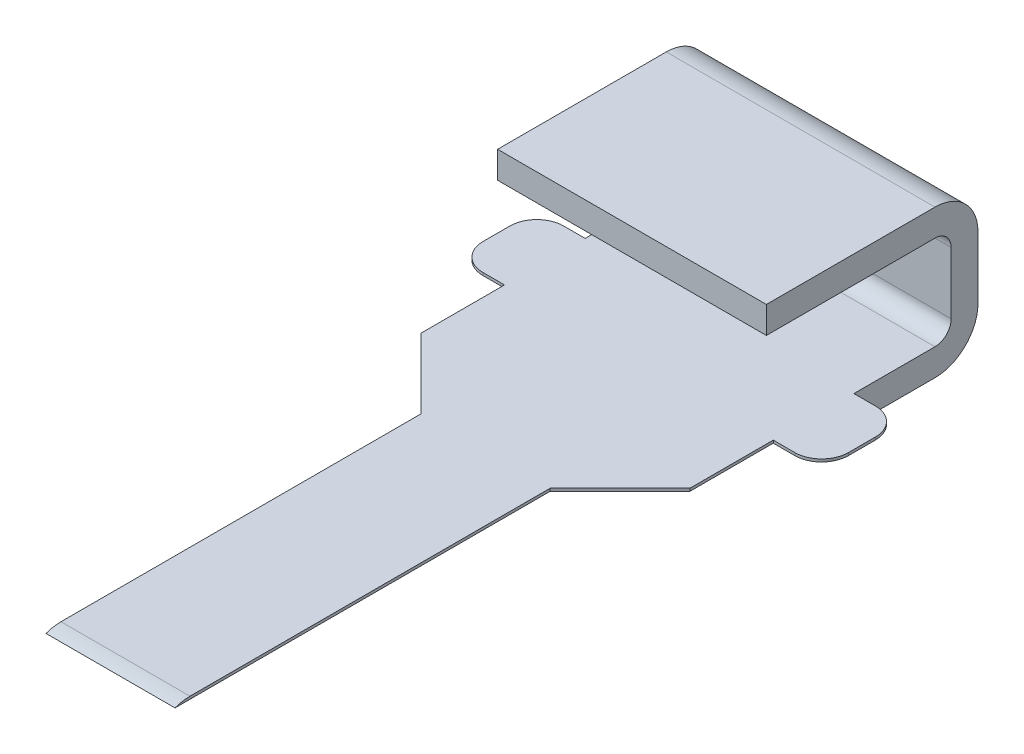
ISO-10303-21;
HEADER;
FILE_DESCRIPTION(('STEP AP214'),'2;1');
FILE_NAME('part.step','',(''),(''),'','','');
FILE_SCHEMA(('AUTOMOTIVE_DESIGN { 1 0 10303 214 1 1 1 1 }'));
ENDSEC;
DATA;
#1=APPLICATION_CONTEXT('core data for automotive mechanical design processes');
#2=APPLICATION_PROTOCOL_DEFINITION('international standard','automotive_design',2000,#1);
#3=PRODUCT_CONTEXT('',#1,'mechanical');
#4=PRODUCT('Part','Part','',(#3));
#5=PRODUCT_RELATED_PRODUCT_CATEGORY('part','',(#4));
#6=PRODUCT_DEFINITION_FORMATION('','',#4);
#7=PRODUCT_DEFINITION_CONTEXT('part definition',#1,'design');
#8=PRODUCT_DEFINITION('design','',#6,#7);
#9=PRODUCT_DEFINITION_SHAPE('','',#8);
#10=(LENGTH_UNIT() NAMED_UNIT(*) SI_UNIT(.MILLI.,.METRE.));
#11=(NAMED_UNIT(*) PLANE_ANGLE_UNIT() SI_UNIT($,.RADIAN.));
#12=(NAMED_UNIT(*) SI_UNIT($,.STERADIAN.) SOLID_ANGLE_UNIT());
#13=UNCERTAINTY_MEASURE_WITH_UNIT(LENGTH_MEASURE(1.E-05),#10,'distance_accuracy_value','');
#14=(GEOMETRIC_REPRESENTATION_CONTEXT(3) GLOBAL_UNCERTAINTY_ASSIGNED_CONTEXT((#13)) GLOBAL_UNIT_ASSIGNED_CONTEXT((#10,
#11,#12)) REPRESENTATION_CONTEXT('',''));
#15=CARTESIAN_POINT('',(0.,0.,0.));
#16=DIRECTION('',(0.,0.,1.));
#17=DIRECTION('',(1.,0.,0.));
#18=AXIS2_PLACEMENT_3D('',#15,#16,#17);
#19=CARTESIAN_POINT('',(-0.6096,2.41935,-0.806672989791002));
#20=DIRECTION('',(1.,0.,0.));
#21=DIRECTION('',(0.,0.,-1.));
#22=AXIS2_PLACEMENT_3D('',#19,#20,#21);
#23=PLANE('',#22);
#24=DIRECTION('',(0.,1.,0.));
#25=VECTOR('',#24,1.);
#26=CARTESIAN_POINT('',(-0.6096,2.41935,-2.03883729316359));
#27=LINE('',#26,#25);
#28=CARTESIAN_POINT('',(-0.6096,2.413,-2.03883729316359));
#29=VERTEX_POINT('',#28);
#30=CARTESIAN_POINT('',(-0.6096,2.4257,-2.03883729316359));
#31=VERTEX_POINT('',#30);
#32=EDGE_CURVE('E136',#29,#31,#27,.T.);
#33=ORIENTED_EDGE('',*,*,#32,.F.);
#34=DIRECTION('',(0.,0.,1.));
#35=VECTOR('',#34,1.);
#36=CARTESIAN_POINT('',(-0.6096,2.413,-1.70476768608671));
#37=LINE('',#36,#35);
#38=CARTESIAN_POINT('',(-0.6096,2.41300000000002,-0.265798079010277));
#39=VERTEX_POINT('',#38);
#40=EDGE_CURVE('E192',#29,#39,#37,.T.);
#41=ORIENTED_EDGE('',*,*,#40,.T.);
#42=CARTESIAN_POINT('',(-0.6096,2.2225,-0.336508686418162));
#43=DIRECTION('',(1.,0.,0.));
#44=DIRECTION('',(0.,0.,-1.));
#45=AXIS2_PLACEMENT_3D('',#42,#43,#44);
#46=CIRCLE('',#45,0.2032);
#47=CARTESIAN_POINT('',(-0.6096,2.4257,-0.336508686418162));
#48=VERTEX_POINT('',#47);
#49=EDGE_CURVE('E19',#48,#39,#46,.T.);
#50=ORIENTED_EDGE('',*,*,#49,.F.);
#51=DIRECTION('',(0.,0.,-1.));
#52=VECTOR('',#51,1.);
#53=CARTESIAN_POINT('',(-0.6096,2.4257,-0.806672989791002));
#54=LINE('',#53,#52);
#55=EDGE_CURVE('E128',#31,#48,#54,.F.);
#56=ORIENTED_EDGE('',*,*,#55,.F.);
#57=EDGE_LOOP('',(#33,#41,#50,#56));
#58=FACE_BOUND('',#57,.T.);
#59=ADVANCED_FACE('F16',(#58),#23,.F.);
#60=CARTESIAN_POINT('',(-0.3048,2.413,-1.70476768608671));
#61=DIRECTION('',(0.,1.,0.));
#62=DIRECTION('',(0.,0.,1.));
#63=AXIS2_PLACEMENT_3D('',#60,#61,#62);
#64=PLANE('',#63);
#65=DIRECTION('',(0.,0.,1.));
#66=VECTOR('',#65,1.);
#67=CARTESIAN_POINT('',(0.5588,2.413,-1.70476768608671));
#68=LINE('',#67,#66);
#69=CARTESIAN_POINT('',(0.5588,2.413,-2.88973729316308));
#70=VERTEX_POINT('',#69);
#71=CARTESIAN_POINT('',(0.5588,2.413,-3.01673729316308));
#72=VERTEX_POINT('',#71);
#73=EDGE_CURVE('E382',#70,#72,#68,.F.);
#74=ORIENTED_EDGE('',*,*,#73,.F.);
#75=CARTESIAN_POINT('',(0.4318,2.413,-2.88973729316308));
#76=DIRECTION('',(0.,1.,0.));
#77=DIRECTION('',(0.,0.,1.));
#78=AXIS2_PLACEMENT_3D('',#75,#76,#77);
#79=CIRCLE('',#78,0.127);
#80=CARTESIAN_POINT('',(0.4318,2.413,-2.76273729316308));
#81=VERTEX_POINT('',#80);
#82=EDGE_CURVE('E384',#81,#70,#79,.T.);
#83=ORIENTED_EDGE('',*,*,#82,.F.);
#84=DIRECTION('',(1.,0.,0.));
#85=VECTOR('',#84,1.);
#86=CARTESIAN_POINT('',(-0.3048,2.413,-2.76273729316308));
#87=LINE('',#86,#85);
#88=CARTESIAN_POINT('',(0.3302,2.413,-2.76273729316308));
#89=VERTEX_POINT('',#88);
#90=EDGE_CURVE('E385',#89,#81,#87,.T.);
#91=ORIENTED_EDGE('',*,*,#90,.F.);
#92=DIRECTION('',(0.,0.,1.));
#93=VECTOR('',#92,1.);
#94=CARTESIAN_POINT('',(0.3302,2.413,-1.70476768608671));
#95=LINE('',#94,#93);
#96=CARTESIAN_POINT('',(0.3302,2.413,-2.36903729316359));
#97=VERTEX_POINT('',#96);
#98=EDGE_CURVE('E387',#97,#89,#95,.F.);
#99=ORIENTED_EDGE('',*,*,#98,.F.);
#100=DIRECTION('',(0.707106781186547,0.,-0.707106781186548));
#101=VECTOR('',#100,1.);
#102=CARTESIAN_POINT('',(0.,2.413,-2.03883729316359));
#103=LINE('',#102,#101);
#104=CARTESIAN_POINT('',(0.,2.413,-2.03883729316358));
#105=VERTEX_POINT('',#104);
#106=EDGE_CURVE('E392',#105,#97,#103,.T.);
#107=ORIENTED_EDGE('',*,*,#106,.F.);
#108=DIRECTION('',(0.,0.,-1.));
#109=VECTOR('',#108,1.);
#110=CARTESIAN_POINT('',(0.,2.413,-1.65783729316359));
#111=LINE('',#110,#109);
#112=CARTESIAN_POINT('',(0.,2.41300000000002,-0.265798079010277));
#113=VERTEX_POINT('',#112);
#114=EDGE_CURVE('E265',#113,#105,#111,.T.);
#115=ORIENTED_EDGE('',*,*,#114,.F.);
#116=DIRECTION('',(1.,0.,0.));
#117=VECTOR('',#116,1.);
#118=CARTESIAN_POINT('',(0.012192,2.41300000000004,-0.265798079010332));
#119=LINE('',#118,#117);
#120=EDGE_CURVE('E397',#39,#113,#119,.T.);
#121=ORIENTED_EDGE('',*,*,#120,.F.);
#122=ORIENTED_EDGE('',*,*,#40,.F.);
#123=DIRECTION('',(-0.707106781186548,0.,-0.707106781186548));
#124=VECTOR('',#123,1.);
#125=CARTESIAN_POINT('',(-0.7747,2.413,-2.20393729316359));
#126=LINE('',#125,#124);
#127=CARTESIAN_POINT('',(-0.9398,2.413,-2.36903729316359));
#128=VERTEX_POINT('',#127);
#129=EDGE_CURVE('E294',#29,#128,#126,.T.);
#130=ORIENTED_EDGE('',*,*,#129,.T.);
#131=DIRECTION('',(0.,0.,-1.));
#132=VECTOR('',#131,1.);
#133=CARTESIAN_POINT('',(-0.9398,2.413,-2.56588729316308));
#134=LINE('',#133,#132);
#135=CARTESIAN_POINT('',(-0.9398,2.413,-2.76273729316308));
#136=VERTEX_POINT('',#135);
#137=EDGE_CURVE('E295',#128,#136,#134,.T.);
#138=ORIENTED_EDGE('',*,*,#137,.T.);
#139=DIRECTION('',(1.,0.,0.));
#140=VECTOR('',#139,1.);
#141=CARTESIAN_POINT('',(-0.9906,2.413,-2.76273729316308));
#142=LINE('',#141,#140);
#143=CARTESIAN_POINT('',(-1.0414,2.413,-2.76273729316308));
#144=VERTEX_POINT('',#143);
#145=EDGE_CURVE('E283',#144,#136,#142,.T.);
#146=ORIENTED_EDGE('',*,*,#145,.F.);
#147=CARTESIAN_POINT('',(-1.0414,2.413,-2.88973729316308));
#148=DIRECTION('',(0.,1.,0.));
#149=DIRECTION('',(0.,0.,1.));
#150=AXIS2_PLACEMENT_3D('',#147,#148,#149);
#151=CIRCLE('',#150,0.127);
#152=CARTESIAN_POINT('',(-1.1684,2.413,-2.88973729316308));
#153=VERTEX_POINT('',#152);
#154=EDGE_CURVE('E284',#153,#144,#151,.T.);
#155=ORIENTED_EDGE('',*,*,#154,.F.);
#156=DIRECTION('',(0.,0.,-1.));
#157=VECTOR('',#156,1.);
#158=CARTESIAN_POINT('',(-1.1684,2.413,-2.95323729316308));
#159=LINE('',#158,#157);
#160=CARTESIAN_POINT('',(-1.1684,2.413,-3.01673729316308));
#161=VERTEX_POINT('',#160);
#162=EDGE_CURVE('E303',#153,#161,#159,.T.);
#163=ORIENTED_EDGE('',*,*,#162,.T.);
#164=CARTESIAN_POINT('',(-1.0414,2.413,-3.01673729316308));
#165=DIRECTION('',(0.,1.,0.));
#166=DIRECTION('',(0.,0.,1.));
#167=AXIS2_PLACEMENT_3D('',#164,#165,#166);
#168=CIRCLE('',#167,0.127);
#169=CARTESIAN_POINT('',(-1.0414,2.413,-3.14373729316308));
#170=VERTEX_POINT('',#169);
#171=EDGE_CURVE('E307',#170,#161,#168,.T.);
#172=ORIENTED_EDGE('',*,*,#171,.F.);
#173=DIRECTION('',(1.,0.,0.));
#174=VECTOR('',#173,1.);
#175=CARTESIAN_POINT('',(-0.9906,2.413,-3.14373729316308));
#176=LINE('',#175,#174);
#177=CARTESIAN_POINT('',(-0.9398,2.413,-3.14373729316308));
#178=VERTEX_POINT('',#177);
#179=EDGE_CURVE('E201',#170,#178,#176,.T.);
#180=ORIENTED_EDGE('',*,*,#179,.T.);
#181=DIRECTION('',(1.,0.,0.));
#182=VECTOR('',#181,1.);
#183=CARTESIAN_POINT('',(-0.3048,2.413,-3.14373729316308));
#184=LINE('',#183,#182);
#185=CARTESIAN_POINT('',(0.3302,2.413,-3.14373729316308));
#186=VERTEX_POINT('',#185);
#187=EDGE_CURVE('E196',#186,#178,#184,.F.);
#188=ORIENTED_EDGE('',*,*,#187,.F.);
#189=DIRECTION('',(1.,0.,0.));
#190=VECTOR('',#189,1.);
#191=CARTESIAN_POINT('',(-0.3048,2.413,-3.14373729316308));
#192=LINE('',#191,#190);
#193=CARTESIAN_POINT('',(0.4318,2.413,-3.14373729316308));
#194=VERTEX_POINT('',#193);
#195=EDGE_CURVE('E183',#194,#186,#192,.F.);
#196=ORIENTED_EDGE('',*,*,#195,.F.);
#197=CARTESIAN_POINT('',(0.4318,2.413,-3.01673729316308));
#198=DIRECTION('',(0.,1.,0.));
#199=DIRECTION('',(0.,0.,1.));
#200=AXIS2_PLACEMENT_3D('',#197,#198,#199);
#201=CIRCLE('',#200,0.127);
#202=EDGE_CURVE('E378',#72,#194,#201,.T.);
#203=ORIENTED_EDGE('',*,*,#202,.F.);
#204=EDGE_LOOP('',(#74,#83,#91,#99,#107,#115,#121,#122,#130,#138,#146,#155,#163,#172,#180,#188,
#196,#203));
#205=FACE_BOUND('',#204,.T.);
#206=ADVANCED_FACE('F199',(#205),#64,.F.);
#207=CARTESIAN_POINT('',(-0.3048,2.2987,-3.33536524658154));
#208=DIRECTION('',(0.,1.,0.));
#209=DIRECTION('',(0.,0.,1.));
#210=AXIS2_PLACEMENT_3D('',#207,#208,#209);
#211=PLANE('',#210);
#212=DIRECTION('',(1.,0.,0.));
#213=VECTOR('',#212,1.);
#214=CARTESIAN_POINT('',(0.3556,2.2987,-3.5269932));
#215=LINE('',#214,#213);
#216=CARTESIAN_POINT('',(0.3302,2.2987,-3.5269932));
#217=VERTEX_POINT('',#216);
#218=CARTESIAN_POINT('',(-0.9398,2.2987,-3.5269932));
#219=VERTEX_POINT('',#218);
#220=EDGE_CURVE('E375',#217,#219,#215,.F.);
#221=ORIENTED_EDGE('',*,*,#220,.F.);
#222=DIRECTION('',(0.,0.,-1.));
#223=VECTOR('',#222,1.);
#224=CARTESIAN_POINT('',(0.3302,2.2987,-3.33536524658154));
#225=LINE('',#224,#223);
#226=CARTESIAN_POINT('',(0.3302,2.2987,-3.14373729316308));
#227=VERTEX_POINT('',#226);
#228=EDGE_CURVE('E230',#227,#217,#225,.T.);
#229=ORIENTED_EDGE('',*,*,#228,.F.);
#230=DIRECTION('',(1.,0.,0.));
#231=VECTOR('',#230,1.);
#232=CARTESIAN_POINT('',(-0.3048,2.2987,-3.14373729316308));
#233=LINE('',#232,#231);
#234=CARTESIAN_POINT('',(-0.9398,2.2987,-3.14373729316308));
#235=VERTEX_POINT('',#234);
#236=EDGE_CURVE('E205',#235,#227,#233,.T.);
#237=ORIENTED_EDGE('',*,*,#236,.F.);
#238=DIRECTION('',(0.,0.,-1.));
#239=VECTOR('',#238,1.);
#240=CARTESIAN_POINT('',(-0.9398,2.2987,-3.12858903352062));
#241=LINE('',#240,#239);
#242=EDGE_CURVE('E335',#235,#219,#241,.T.);
#243=ORIENTED_EDGE('',*,*,#242,.T.);
#244=EDGE_LOOP('',(#221,#229,#237,#243));
#245=FACE_BOUND('',#244,.T.);
#246=ADVANCED_FACE('F872',(#245),#211,.F.);
#247=CARTESIAN_POINT('',(0.3556,2.5019,-3.5269932));
#248=DIRECTION('',(1.,0.,0.));
#249=DIRECTION('',(0.,0.,-1.));
#250=AXIS2_PLACEMENT_3D('',#247,#248,#249);
#251=CYLINDRICAL_SURFACE('',#250,0.2032);
#252=CARTESIAN_POINT('',(-0.9398,2.5019,-3.5269932));
#253=DIRECTION('',(1.,0.,0.));
#254=DIRECTION('',(0.,0.,-1.));
#255=AXIS2_PLACEMENT_3D('',#252,#253,#254);
#256=CIRCLE('',#255,0.2032);
#257=CARTESIAN_POINT('',(-0.9398,2.5019,-3.7301932));
#258=VERTEX_POINT('',#257);
#259=EDGE_CURVE('E334',#219,#258,#256,.T.);
#260=ORIENTED_EDGE('',*,*,#259,.T.);
#261=DIRECTION('',(1.,0.,0.));
#262=VECTOR('',#261,1.);
#263=CARTESIAN_POINT('',(-0.3048,2.5019,-3.7301932));
#264=LINE('',#263,#262);
#265=CARTESIAN_POINT('',(0.3302,2.5019,-3.7301932));
#266=VERTEX_POINT('',#265);
#267=EDGE_CURVE('E373',#258,#266,#264,.T.);
#268=ORIENTED_EDGE('',*,*,#267,.T.);
#269=CARTESIAN_POINT('',(0.3302,2.5019,-3.5269932));
#270=DIRECTION('',(1.,0.,0.));
#271=DIRECTION('',(0.,0.,-1.));
#272=AXIS2_PLACEMENT_3D('',#269,#270,#271);
#273=CIRCLE('',#272,0.2032);
#274=EDGE_CURVE('E467',#217,#266,#273,.T.);
#275=ORIENTED_EDGE('',*,*,#274,.F.);
#276=ORIENTED_EDGE('',*,*,#220,.T.);
#277=EDGE_LOOP('',(#260,#268,#275,#276));
#278=FACE_BOUND('',#277,.T.);
#279=ADVANCED_FACE('F862',(#278),#251,.T.);
#280=CARTESIAN_POINT('',(-0.3048,2.64795,-3.7301932));
#281=DIRECTION('',(0.,0.,1.));
#282=DIRECTION('',(1.,0.,0.));
#283=AXIS2_PLACEMENT_3D('',#280,#281,#282);
#284=PLANE('',#283);
#285=ORIENTED_EDGE('',*,*,#267,.F.);
#286=DIRECTION('',(0.,1.,0.));
#287=VECTOR('',#286,1.);
#288=CARTESIAN_POINT('',(-0.9398,2.9337,-3.7301932));
#289=LINE('',#288,#287);
#290=CARTESIAN_POINT('',(-0.9398,2.794,-3.7301932));
#291=VERTEX_POINT('',#290);
#292=EDGE_CURVE('E332',#258,#291,#289,.T.);
#293=ORIENTED_EDGE('',*,*,#292,.T.);
#294=DIRECTION('',(1.,0.,0.));
#295=VECTOR('',#294,1.);
#296=CARTESIAN_POINT('',(0.3556,2.794,-3.7301932));
#297=LINE('',#296,#295);
#298=CARTESIAN_POINT('',(0.3302,2.794,-3.7301932));
#299=VERTEX_POINT('',#298);
#300=EDGE_CURVE('E370',#299,#291,#297,.F.);
#301=ORIENTED_EDGE('',*,*,#300,.F.);
#302=DIRECTION('',(0.,1.,0.));
#303=VECTOR('',#302,1.);
#304=CARTESIAN_POINT('',(0.3302,2.3622,-3.7301932));
#305=LINE('',#304,#303);
#306=EDGE_CURVE('E466',#266,#299,#305,.T.);
#307=ORIENTED_EDGE('',*,*,#306,.F.);
#308=EDGE_LOOP('',(#285,#293,#301,#307));
#309=FACE_BOUND('',#308,.T.);
#310=ADVANCED_FACE('F852',(#309),#284,.F.);
#311=CARTESIAN_POINT('',(0.3556,2.794,-3.5269932));
#312=DIRECTION('',(1.,0.,0.));
#313=DIRECTION('',(0.,0.,-1.));
#314=AXIS2_PLACEMENT_3D('',#311,#312,#313);
#315=CYLINDRICAL_SURFACE('',#314,0.2032);
#316=CARTESIAN_POINT('',(-0.9398,2.794,-3.5269932));
#317=DIRECTION('',(1.,0.,0.));
#318=DIRECTION('',(0.,0.,-1.));
#319=AXIS2_PLACEMENT_3D('',#316,#317,#318);
#320=CIRCLE('',#319,0.2032);
#321=CARTESIAN_POINT('',(-0.9398,2.9972,-3.5269932));
#322=VERTEX_POINT('',#321);
#323=EDGE_CURVE('E329',#291,#322,#320,.T.);
#324=ORIENTED_EDGE('',*,*,#323,.T.);
#325=DIRECTION('',(1.,0.,0.));
#326=VECTOR('',#325,1.);
#327=CARTESIAN_POINT('',(-0.3048,2.9972,-3.5269932));
#328=LINE('',#327,#326);
#329=CARTESIAN_POINT('',(0.3302,2.9972,-3.5269932));
#330=VERTEX_POINT('',#329);
#331=EDGE_CURVE('E365',#330,#322,#328,.F.);
#332=ORIENTED_EDGE('',*,*,#331,.F.);
#333=CARTESIAN_POINT('',(0.3302,2.794,-3.5269932));
#334=DIRECTION('',(1.,0.,0.));
#335=DIRECTION('',(0.,0.,-1.));
#336=AXIS2_PLACEMENT_3D('',#333,#334,#335);
#337=CIRCLE('',#336,0.2032);
#338=EDGE_CURVE('E463',#299,#330,#337,.T.);
#339=ORIENTED_EDGE('',*,*,#338,.F.);
#340=ORIENTED_EDGE('',*,*,#300,.T.);
#341=EDGE_LOOP('',(#324,#332,#339,#340));
#342=FACE_BOUND('',#341,.T.);
#343=ADVANCED_FACE('F842',(#342),#315,.T.);
#344=CARTESIAN_POINT('',(-0.3048,2.9972,-3.12858903351808));
#345=DIRECTION('',(0.,1.,0.));
#346=DIRECTION('',(0.,0.,1.));
#347=AXIS2_PLACEMENT_3D('',#344,#345,#346);
#348=PLANE('',#347);
#349=DIRECTION('',(1.,0.,0.));
#350=VECTOR('',#349,1.);
#351=CARTESIAN_POINT('',(-0.3048,2.9972,-2.7301848670387));
#352=LINE('',#351,#350);
#353=CARTESIAN_POINT('',(0.3302,2.9972,-2.7301848670387));
#354=VERTEX_POINT('',#353);
#355=CARTESIAN_POINT('',(-0.9398,2.9972,-2.7301848670387));
#356=VERTEX_POINT('',#355);
#357=EDGE_CURVE('E353',#354,#356,#352,.F.);
#358=ORIENTED_EDGE('',*,*,#357,.F.);
#359=DIRECTION('',(0.,0.,-1.));
#360=VECTOR('',#359,1.);
#361=CARTESIAN_POINT('',(0.3302,2.9972,-3.33536524658154));
#362=LINE('',#361,#360);
#363=EDGE_CURVE('E360',#330,#354,#362,.F.);
#364=ORIENTED_EDGE('',*,*,#363,.F.);
#365=ORIENTED_EDGE('',*,*,#331,.T.);
#366=DIRECTION('',(0.,0.,-1.));
#367=VECTOR('',#366,1.);
#368=CARTESIAN_POINT('',(-0.9398,2.9972,-3.12858903352062));
#369=LINE('',#368,#367);
#370=EDGE_CURVE('E326',#322,#356,#369,.F.);
#371=ORIENTED_EDGE('',*,*,#370,.T.);
#372=EDGE_LOOP('',(#358,#364,#365,#371));
#373=FACE_BOUND('',#372,.T.);
#374=ADVANCED_FACE('F832',(#373),#348,.T.);
#375=CARTESIAN_POINT('',(-0.3048,2.9337,-2.7301848670387));
#376=DIRECTION('',(0.,0.,1.));
#377=DIRECTION('',(1.,0.,0.));
#378=AXIS2_PLACEMENT_3D('',#375,#376,#377);
#379=PLANE('',#378);
#380=DIRECTION('',(0.,1.,0.));
#381=VECTOR('',#380,1.);
#382=CARTESIAN_POINT('',(-0.9398,2.9337,-2.7301848670387));
#383=LINE('',#382,#381);
#384=CARTESIAN_POINT('',(-0.9398,2.8702,-2.7301848670387));
#385=VERTEX_POINT('',#384);
#386=EDGE_CURVE('E323',#356,#385,#383,.F.);
#387=ORIENTED_EDGE('',*,*,#386,.T.);
#388=DIRECTION('',(1.,0.,0.));
#389=VECTOR('',#388,1.);
#390=CARTESIAN_POINT('',(-0.3048,2.8702,-2.7301848670387));
#391=LINE('',#390,#389);
#392=CARTESIAN_POINT('',(0.3302,2.8702,-2.7301848670387));
#393=VERTEX_POINT('',#392);
#394=EDGE_CURVE('E350',#385,#393,#391,.T.);
#395=ORIENTED_EDGE('',*,*,#394,.T.);
#396=DIRECTION('',(0.,1.,0.));
#397=VECTOR('',#396,1.);
#398=CARTESIAN_POINT('',(0.3302,2.3622,-2.7301848670387));
#399=LINE('',#398,#397);
#400=EDGE_CURVE('E356',#354,#393,#399,.F.);
#401=ORIENTED_EDGE('',*,*,#400,.F.);
#402=ORIENTED_EDGE('',*,*,#357,.T.);
#403=EDGE_LOOP('',(#387,#395,#401,#402));
#404=FACE_BOUND('',#403,.T.);
#405=ADVANCED_FACE('F822',(#404),#379,.T.);
#406=CARTESIAN_POINT('',(-0.3048,2.8702,-3.12858903351808));
#407=DIRECTION('',(0.,1.,0.));
#408=DIRECTION('',(0.,0.,1.));
#409=AXIS2_PLACEMENT_3D('',#406,#407,#408);
#410=PLANE('',#409);
#411=DIRECTION('',(0.,0.,-1.));
#412=VECTOR('',#411,1.);
#413=CARTESIAN_POINT('',(0.3302,2.8702,-3.33536524658154));
#414=LINE('',#413,#412);
#415=CARTESIAN_POINT('',(0.3302,2.8702,-3.5269932));
#416=VERTEX_POINT('',#415);
#417=EDGE_CURVE('E359',#393,#416,#414,.T.);
#418=ORIENTED_EDGE('',*,*,#417,.F.);
#419=ORIENTED_EDGE('',*,*,#394,.F.);
#420=DIRECTION('',(0.,0.,-1.));
#421=VECTOR('',#420,1.);
#422=CARTESIAN_POINT('',(-0.9398,2.8702,-3.12858903352062));
#423=LINE('',#422,#421);
#424=CARTESIAN_POINT('',(-0.9398,2.8702,-3.5269932));
#425=VERTEX_POINT('',#424);
#426=EDGE_CURVE('E320',#385,#425,#423,.T.);
#427=ORIENTED_EDGE('',*,*,#426,.T.);
#428=DIRECTION('',(1.,0.,0.));
#429=VECTOR('',#428,1.);
#430=CARTESIAN_POINT('',(0.3556,2.8702,-3.5269932));
#431=LINE('',#430,#429);
#432=EDGE_CURVE('E206',#425,#416,#431,.T.);
#433=ORIENTED_EDGE('',*,*,#432,.T.);
#434=EDGE_LOOP('',(#418,#419,#427,#433));
#435=FACE_BOUND('',#434,.T.);
#436=ADVANCED_FACE('F812',(#435),#410,.F.);
#437=CARTESIAN_POINT('',(0.3556,2.794,-3.5269932));
#438=DIRECTION('',(1.,0.,0.));
#439=DIRECTION('',(0.,0.,-1.));
#440=AXIS2_PLACEMENT_3D('',#437,#438,#439);
#441=CYLINDRICAL_SURFACE('',#440,0.0762);
#442=DIRECTION('',(1.,0.,0.));
#443=VECTOR('',#442,1.);
#444=CARTESIAN_POINT('',(-0.3048,2.794,-3.6031932));
#445=LINE('',#444,#443);
#446=CARTESIAN_POINT('',(0.3302,2.794,-3.6031932));
#447=VERTEX_POINT('',#446);
#448=CARTESIAN_POINT('',(-0.9398,2.794,-3.6031932));
#449=VERTEX_POINT('',#448);
#450=EDGE_CURVE('E347',#447,#449,#445,.F.);
#451=ORIENTED_EDGE('',*,*,#450,.F.);
#452=CARTESIAN_POINT('',(0.3302,2.794,-3.5269932));
#453=DIRECTION('',(1.,0.,0.));
#454=DIRECTION('',(0.,0.,-1.));
#455=AXIS2_PLACEMENT_3D('',#452,#453,#454);
#456=CIRCLE('',#455,0.0762);
#457=EDGE_CURVE('E221',#416,#447,#456,.F.);
#458=ORIENTED_EDGE('',*,*,#457,.F.);
#459=ORIENTED_EDGE('',*,*,#432,.F.);
#460=CARTESIAN_POINT('',(-0.9398,2.794,-3.5269932));
#461=DIRECTION('',(1.,0.,0.));
#462=DIRECTION('',(0.,0.,-1.));
#463=AXIS2_PLACEMENT_3D('',#460,#461,#462);
#464=CIRCLE('',#463,0.0762);
#465=EDGE_CURVE('E341',#425,#449,#464,.F.);
#466=ORIENTED_EDGE('',*,*,#465,.T.);
#467=EDGE_LOOP('',(#451,#458,#459,#466));
#468=FACE_BOUND('',#467,.T.);
#469=ADVANCED_FACE('F803',(#468),#441,.F.);
#470=CARTESIAN_POINT('',(-0.3048,2.35585,-3.14373729316308));
#471=DIRECTION('',(0.,0.,1.));
#472=DIRECTION('',(1.,0.,0.));
#473=AXIS2_PLACEMENT_3D('',#470,#471,#472);
#474=PLANE('',#473);
#475=ORIENTED_EDGE('',*,*,#236,.T.);
#476=DIRECTION('',(0.,1.,0.));
#477=VECTOR('',#476,1.);
#478=CARTESIAN_POINT('',(0.3302,2.3622,-3.14373729316308));
#479=LINE('',#478,#477);
#480=EDGE_CURVE('E210',#186,#227,#479,.F.);
#481=ORIENTED_EDGE('',*,*,#480,.F.);
#482=ORIENTED_EDGE('',*,*,#187,.T.);
#483=DIRECTION('',(0.,1.,0.));
#484=VECTOR('',#483,1.);
#485=CARTESIAN_POINT('',(-0.9398,2.9337,-3.14373729316308));
#486=LINE('',#485,#484);
#487=EDGE_CURVE('E337',#178,#235,#486,.F.);
#488=ORIENTED_EDGE('',*,*,#487,.T.);
#489=EDGE_LOOP('',(#475,#481,#482,#488));
#490=FACE_BOUND('',#489,.T.);
#491=ADVANCED_FACE('F211',(#490),#474,.T.);
#492=CARTESIAN_POINT('',(-0.3048,2.64795,-3.6031932));
#493=DIRECTION('',(0.,0.,1.));
#494=DIRECTION('',(1.,0.,0.));
#495=AXIS2_PLACEMENT_3D('',#492,#493,#494);
#496=PLANE('',#495);
#497=DIRECTION('',(0.,1.,0.));
#498=VECTOR('',#497,1.);
#499=CARTESIAN_POINT('',(0.3302,2.3622,-3.6031932));
#500=LINE('',#499,#498);
#501=CARTESIAN_POINT('',(0.3302,2.5019,-3.6031932));
#502=VERTEX_POINT('',#501);
#503=EDGE_CURVE('E219',#447,#502,#500,.F.);
#504=ORIENTED_EDGE('',*,*,#503,.F.);
#505=ORIENTED_EDGE('',*,*,#450,.T.);
#506=DIRECTION('',(0.,1.,0.));
#507=VECTOR('',#506,1.);
#508=CARTESIAN_POINT('',(-0.9398,2.9337,-3.6031932));
#509=LINE('',#508,#507);
#510=CARTESIAN_POINT('',(-0.9398,2.5019,-3.6031932));
#511=VERTEX_POINT('',#510);
#512=EDGE_CURVE('E177',#449,#511,#509,.F.);
#513=ORIENTED_EDGE('',*,*,#512,.T.);
#514=DIRECTION('',(1.,0.,0.));
#515=VECTOR('',#514,1.);
#516=CARTESIAN_POINT('',(0.3556,2.5019,-3.6031932));
#517=LINE('',#516,#515);
#518=EDGE_CURVE('E214',#511,#502,#517,.T.);
#519=ORIENTED_EDGE('',*,*,#518,.T.);
#520=EDGE_LOOP('',(#504,#505,#513,#519));
#521=FACE_BOUND('',#520,.T.);
#522=ADVANCED_FACE('F786',(#521),#496,.T.);
#523=CARTESIAN_POINT('',(-0.9398,2.9337,-3.12858903352062));
#524=DIRECTION('',(1.,0.,0.));
#525=DIRECTION('',(0.,0.,-1.));
#526=AXIS2_PLACEMENT_3D('',#523,#524,#525);
#527=PLANE('',#526);
#528=ORIENTED_EDGE('',*,*,#386,.F.);
#529=ORIENTED_EDGE('',*,*,#370,.F.);
#530=ORIENTED_EDGE('',*,*,#323,.F.);
#531=ORIENTED_EDGE('',*,*,#292,.F.);
#532=ORIENTED_EDGE('',*,*,#259,.F.);
#533=ORIENTED_EDGE('',*,*,#242,.F.);
#534=ORIENTED_EDGE('',*,*,#487,.F.);
#535=DIRECTION('',(0.,1.,0.));
#536=VECTOR('',#535,1.);
#537=CARTESIAN_POINT('',(-0.9398,2.41935,-3.14373729316308));
#538=LINE('',#537,#536);
#539=CARTESIAN_POINT('',(-0.9398,2.4257,-3.14373729316308));
#540=VERTEX_POINT('',#539);
#541=EDGE_CURVE('E308',#178,#540,#538,.T.);
#542=ORIENTED_EDGE('',*,*,#541,.T.);
#543=DIRECTION('',(0.,0.,1.));
#544=VECTOR('',#543,1.);
#545=CARTESIAN_POINT('',(-0.9398,2.4257,-1.93175094320921));
#546=LINE('',#545,#544);
#547=CARTESIAN_POINT('',(-0.9398,2.4257,-3.5269932));
#548=VERTEX_POINT('',#547);
#549=EDGE_CURVE('E313',#548,#540,#546,.T.);
#550=ORIENTED_EDGE('',*,*,#549,.F.);
#551=CARTESIAN_POINT('',(-0.9398,2.5019,-3.5269932));
#552=DIRECTION('',(1.,0.,0.));
#553=DIRECTION('',(0.,0.,-1.));
#554=AXIS2_PLACEMENT_3D('',#551,#552,#553);
#555=CIRCLE('',#554,0.0762);
#556=EDGE_CURVE('E317',#548,#511,#555,.T.);
#557=ORIENTED_EDGE('',*,*,#556,.T.);
#558=ORIENTED_EDGE('',*,*,#512,.F.);
#559=ORIENTED_EDGE('',*,*,#465,.F.);
#560=ORIENTED_EDGE('',*,*,#426,.F.);
#561=EDGE_LOOP('',(#528,#529,#530,#531,#532,#533,#534,#542,#550,#557,#558,#559,#560));
#562=FACE_BOUND('',#561,.T.);
#563=ADVANCED_FACE('F528',(#562),#527,.F.);
#564=CARTESIAN_POINT('',(-0.9906,2.41935,-3.14373729316308));
#565=DIRECTION('',(0.,0.,1.));
#566=DIRECTION('',(1.,0.,0.));
#567=AXIS2_PLACEMENT_3D('',#564,#565,#566);
#568=PLANE('',#567);
#569=DIRECTION('',(1.,0.,0.));
#570=VECTOR('',#569,1.);
#571=CARTESIAN_POINT('',(-0.3048,2.4257,-3.14373729316308));
#572=LINE('',#571,#570);
#573=CARTESIAN_POINT('',(-1.0414,2.4257,-3.14373729316308));
#574=VERTEX_POINT('',#573);
#575=EDGE_CURVE('E316',#540,#574,#572,.F.);
#576=ORIENTED_EDGE('',*,*,#575,.F.);
#577=ORIENTED_EDGE('',*,*,#541,.F.);
#578=ORIENTED_EDGE('',*,*,#179,.F.);
#579=DIRECTION('',(0.,1.,0.));
#580=VECTOR('',#579,1.);
#581=CARTESIAN_POINT('',(-1.0414,2.425954,-3.14373729316308));
#582=LINE('',#581,#580);
#583=EDGE_CURVE('E304',#574,#170,#582,.F.);
#584=ORIENTED_EDGE('',*,*,#583,.F.);
#585=EDGE_LOOP('',(#576,#577,#578,#584));
#586=FACE_BOUND('',#585,.T.);
#587=ADVANCED_FACE('F535',(#586),#568,.F.);
#588=CARTESIAN_POINT('',(-1.0414,2.425954,-3.01673729316308));
#589=DIRECTION('',(0.,1.,0.));
#590=DIRECTION('',(0.,0.,1.));
#591=AXIS2_PLACEMENT_3D('',#588,#589,#590);
#592=CYLINDRICAL_SURFACE('',#591,0.127);
#593=ORIENTED_EDGE('',*,*,#583,.T.);
#594=ORIENTED_EDGE('',*,*,#171,.T.);
#595=DIRECTION('',(0.,1.,0.));
#596=VECTOR('',#595,1.);
#597=CARTESIAN_POINT('',(-1.1684,2.41935,-3.01673729316308));
#598=LINE('',#597,#596);
#599=CARTESIAN_POINT('',(-1.1684,2.4257,-3.01673729316308));
#600=VERTEX_POINT('',#599);
#601=EDGE_CURVE('E301',#161,#600,#598,.T.);
#602=ORIENTED_EDGE('',*,*,#601,.T.);
#603=CARTESIAN_POINT('',(-1.0414,2.4257,-3.01673729316308));
#604=DIRECTION('',(0.,1.,0.));
#605=DIRECTION('',(0.,0.,1.));
#606=AXIS2_PLACEMENT_3D('',#603,#604,#605);
#607=CIRCLE('',#606,0.127);
#608=EDGE_CURVE('E456',#574,#600,#607,.T.);
#609=ORIENTED_EDGE('',*,*,#608,.F.);
#610=EDGE_LOOP('',(#593,#594,#602,#609));
#611=FACE_BOUND('',#610,.T.);
#612=ADVANCED_FACE('F539',(#611),#592,.T.);
#613=CARTESIAN_POINT('',(-1.1684,2.41935,-2.95323729316308));
#614=DIRECTION('',(1.,0.,0.));
#615=DIRECTION('',(0.,0.,-1.));
#616=AXIS2_PLACEMENT_3D('',#613,#614,#615);
#617=PLANE('',#616);
#618=DIRECTION('',(0.,0.,1.));
#619=VECTOR('',#618,1.);
#620=CARTESIAN_POINT('',(-1.1684,2.4257,-1.93175094320921));
#621=LINE('',#620,#619);
#622=CARTESIAN_POINT('',(-1.1684,2.4257,-2.88973729316308));
#623=VERTEX_POINT('',#622);
#624=EDGE_CURVE('E455',#600,#623,#621,.T.);
#625=ORIENTED_EDGE('',*,*,#624,.F.);
#626=ORIENTED_EDGE('',*,*,#601,.F.);
#627=ORIENTED_EDGE('',*,*,#162,.F.);
#628=DIRECTION('',(0.,1.,0.));
#629=VECTOR('',#628,1.);
#630=CARTESIAN_POINT('',(-1.1684,2.425954,-2.88973729316308));
#631=LINE('',#630,#629);
#632=EDGE_CURVE('E298',#623,#153,#631,.F.);
#633=ORIENTED_EDGE('',*,*,#632,.F.);
#634=EDGE_LOOP('',(#625,#626,#627,#633));
#635=FACE_BOUND('',#634,.T.);
#636=ADVANCED_FACE('F542',(#635),#617,.F.);
#637=CARTESIAN_POINT('',(-1.0414,2.425954,-2.88973729316308));
#638=DIRECTION('',(0.,1.,0.));
#639=DIRECTION('',(0.,0.,1.));
#640=AXIS2_PLACEMENT_3D('',#637,#638,#639);
#641=CYLINDRICAL_SURFACE('',#640,0.127);
#642=ORIENTED_EDGE('',*,*,#632,.T.);
#643=ORIENTED_EDGE('',*,*,#154,.T.);
#644=DIRECTION('',(0.,1.,0.));
#645=VECTOR('',#644,1.);
#646=CARTESIAN_POINT('',(-1.0414,2.41935,-2.76273729316308));
#647=LINE('',#646,#645);
#648=CARTESIAN_POINT('',(-1.0414,2.4257,-2.76273729316308));
#649=VERTEX_POINT('',#648);
#650=EDGE_CURVE('E280',#649,#144,#647,.F.);
#651=ORIENTED_EDGE('',*,*,#650,.F.);
#652=CARTESIAN_POINT('',(-1.0414,2.4257,-2.88973729316308));
#653=DIRECTION('',(0.,1.,0.));
#654=DIRECTION('',(0.,0.,1.));
#655=AXIS2_PLACEMENT_3D('',#652,#653,#654);
#656=CIRCLE('',#655,0.127);
#657=EDGE_CURVE('E452',#623,#649,#656,.T.);
#658=ORIENTED_EDGE('',*,*,#657,.F.);
#659=EDGE_LOOP('',(#642,#643,#651,#658));
#660=FACE_BOUND('',#659,.T.);
#661=ADVANCED_FACE('F546',(#660),#641,.T.);
#662=CARTESIAN_POINT('',(-0.9906,2.41935,-2.76273729316308));
#663=DIRECTION('',(0.,0.,1.));
#664=DIRECTION('',(1.,0.,0.));
#665=AXIS2_PLACEMENT_3D('',#662,#663,#664);
#666=PLANE('',#665);
#667=ORIENTED_EDGE('',*,*,#650,.T.);
#668=ORIENTED_EDGE('',*,*,#145,.T.);
#669=DIRECTION('',(0.,1.,0.));
#670=VECTOR('',#669,1.);
#671=CARTESIAN_POINT('',(-0.9398,2.41935,-2.76273729316308));
#672=LINE('',#671,#670);
#673=CARTESIAN_POINT('',(-0.9398,2.4257,-2.76273729316308));
#674=VERTEX_POINT('',#673);
#675=EDGE_CURVE('E291',#136,#674,#672,.T.);
#676=ORIENTED_EDGE('',*,*,#675,.T.);
#677=DIRECTION('',(1.,0.,0.));
#678=VECTOR('',#677,1.);
#679=CARTESIAN_POINT('',(-0.3048,2.4257,-2.76273729316308));
#680=LINE('',#679,#678);
#681=EDGE_CURVE('E288',#649,#674,#680,.T.);
#682=ORIENTED_EDGE('',*,*,#681,.F.);
#683=EDGE_LOOP('',(#667,#668,#676,#682));
#684=FACE_BOUND('',#683,.T.);
#685=ADVANCED_FACE('F551',(#684),#666,.T.);
#686=CARTESIAN_POINT('',(-0.9398,2.41935,-2.56588729316308));
#687=DIRECTION('',(1.,0.,0.));
#688=DIRECTION('',(0.,0.,-1.));
#689=AXIS2_PLACEMENT_3D('',#686,#687,#688);
#690=PLANE('',#689);
#691=DIRECTION('',(0.,0.,1.));
#692=VECTOR('',#691,1.);
#693=CARTESIAN_POINT('',(-0.9398,2.4257,-1.93175094320921));
#694=LINE('',#693,#692);
#695=CARTESIAN_POINT('',(-0.9398,2.4257,-2.36903729316359));
#696=VERTEX_POINT('',#695);
#697=EDGE_CURVE('E285',#674,#696,#694,.T.);
#698=ORIENTED_EDGE('',*,*,#697,.F.);
#699=ORIENTED_EDGE('',*,*,#675,.F.);
#700=ORIENTED_EDGE('',*,*,#137,.F.);
#701=DIRECTION('',(0.,1.,0.));
#702=VECTOR('',#701,1.);
#703=CARTESIAN_POINT('',(-0.9398,2.41935,-2.36903729316359));
#704=LINE('',#703,#702);
#705=EDGE_CURVE('E399',#128,#696,#704,.T.);
#706=ORIENTED_EDGE('',*,*,#705,.T.);
#707=EDGE_LOOP('',(#698,#699,#700,#706));
#708=FACE_BOUND('',#707,.T.);
#709=ADVANCED_FACE('F556',(#708),#690,.F.);
#710=CARTESIAN_POINT('',(-0.7747,2.41935,-2.20393729316359));
#711=DIRECTION('',(0.707106781186548,0.,-0.707106781186548));
#712=DIRECTION('',(-0.707106781186548,0.,-0.707106781186548));
#713=AXIS2_PLACEMENT_3D('',#710,#711,#712);
#714=PLANE('',#713);
#715=DIRECTION('',(0.707106781186547,0.,0.707106781186548));
#716=VECTOR('',#715,1.);
#717=CARTESIAN_POINT('',(-0.9398,2.4257,-2.36903729316359));
#718=LINE('',#717,#716);
#719=EDGE_CURVE('E279',#696,#31,#718,.T.);
#720=ORIENTED_EDGE('',*,*,#719,.F.);
#721=ORIENTED_EDGE('',*,*,#705,.F.);
#722=ORIENTED_EDGE('',*,*,#129,.F.);
#723=ORIENTED_EDGE('',*,*,#32,.T.);
#724=EDGE_LOOP('',(#720,#721,#722,#723));
#725=FACE_BOUND('',#724,.T.);
#726=ADVANCED_FACE('F559',(#725),#714,.F.);
#727=CARTESIAN_POINT('',(0.012192,2.2225,-0.336508686418162));
#728=DIRECTION('',(1.,0.,0.));
#729=DIRECTION('',(0.,0.,-1.));
#730=AXIS2_PLACEMENT_3D('',#727,#728,#729);
#731=CYLINDRICAL_SURFACE('',#730,0.2032);
#732=ORIENTED_EDGE('',*,*,#49,.T.);
#733=ORIENTED_EDGE('',*,*,#120,.T.);
#734=CARTESIAN_POINT('',(0.,2.2225,-0.336508686418162));
#735=DIRECTION('',(1.,0.,0.));
#736=DIRECTION('',(0.,0.,-1.));
#737=AXIS2_PLACEMENT_3D('',#734,#735,#736);
#738=CIRCLE('',#737,0.2032);
#739=CARTESIAN_POINT('',(0.,2.4257,-0.336508686418162));
#740=VERTEX_POINT('',#739);
#741=EDGE_CURVE('E275',#740,#113,#738,.T.);
#742=ORIENTED_EDGE('',*,*,#741,.F.);
#743=DIRECTION('',(1.,0.,0.));
#744=VECTOR('',#743,1.);
#745=CARTESIAN_POINT('',(-0.3048,2.4257,-0.336508686418162));
#746=LINE('',#745,#744);
#747=EDGE_CURVE('E270',#48,#740,#746,.T.);
#748=ORIENTED_EDGE('',*,*,#747,.F.);
#749=EDGE_LOOP('',(#732,#733,#742,#748));
#750=FACE_BOUND('',#749,.T.);
#751=ADVANCED_FACE('F566',(#750),#731,.T.);
#752=CARTESIAN_POINT('',(0.,2.41935,-1.65783729316359));
#753=DIRECTION('',(1.,0.,0.));
#754=DIRECTION('',(0.,0.,-1.));
#755=AXIS2_PLACEMENT_3D('',#752,#753,#754);
#756=PLANE('',#755);
#757=ORIENTED_EDGE('',*,*,#741,.T.);
#758=ORIENTED_EDGE('',*,*,#114,.T.);
#759=DIRECTION('',(0.,1.,0.));
#760=VECTOR('',#759,1.);
#761=CARTESIAN_POINT('',(0.,2.41935,-2.03883729316358));
#762=LINE('',#761,#760);
#763=CARTESIAN_POINT('',(0.,2.4257,-2.03883729316358));
#764=VERTEX_POINT('',#763);
#765=EDGE_CURVE('E255',#764,#105,#762,.F.);
#766=ORIENTED_EDGE('',*,*,#765,.F.);
#767=DIRECTION('',(0.,0.,1.));
#768=VECTOR('',#767,1.);
#769=CARTESIAN_POINT('',(0.,2.4257,-1.93175094320921));
#770=LINE('',#769,#768);
#771=EDGE_CURVE('E260',#740,#764,#770,.F.);
#772=ORIENTED_EDGE('',*,*,#771,.F.);
#773=EDGE_LOOP('',(#757,#758,#766,#772));
#774=FACE_BOUND('',#773,.T.);
#775=ADVANCED_FACE('F589',(#774),#756,.T.);
#776=CARTESIAN_POINT('',(0.1651,2.41935,-2.20393729316359));
#777=DIRECTION('',(0.707106781186598,0.,0.707106781186498));
#778=DIRECTION('',(0.707106781186498,0.,-0.707106781186598));
#779=AXIS2_PLACEMENT_3D('',#776,#777,#778);
#780=PLANE('',#779);
#781=ORIENTED_EDGE('',*,*,#765,.T.);
#782=ORIENTED_EDGE('',*,*,#106,.T.);
#783=DIRECTION('',(0.,1.,0.));
#784=VECTOR('',#783,1.);
#785=CARTESIAN_POINT('',(0.3302,2.41935,-2.36903729316359));
#786=LINE('',#785,#784);
#787=CARTESIAN_POINT('',(0.3302,2.4257,-2.36903729316359));
#788=VERTEX_POINT('',#787);
#789=EDGE_CURVE('E243',#788,#97,#786,.F.);
#790=ORIENTED_EDGE('',*,*,#789,.F.);
#791=DIRECTION('',(0.707106781186547,0.,-0.707106781186548));
#792=VECTOR('',#791,1.);
#793=CARTESIAN_POINT('',(0.,2.4257,-2.03883729316359));
#794=LINE('',#793,#792);
#795=EDGE_CURVE('E250',#764,#788,#794,.T.);
#796=ORIENTED_EDGE('',*,*,#795,.F.);
#797=EDGE_LOOP('',(#781,#782,#790,#796));
#798=FACE_BOUND('',#797,.T.);
#799=ADVANCED_FACE('F592',(#798),#780,.T.);
#800=CARTESIAN_POINT('',(0.3302,2.41935,-2.56588729316308));
#801=DIRECTION('',(1.,0.,0.));
#802=DIRECTION('',(0.,0.,-1.));
#803=AXIS2_PLACEMENT_3D('',#800,#801,#802);
#804=PLANE('',#803);
#805=ORIENTED_EDGE('',*,*,#789,.T.);
#806=ORIENTED_EDGE('',*,*,#98,.T.);
#807=DIRECTION('',(0.,1.,0.));
#808=VECTOR('',#807,1.);
#809=CARTESIAN_POINT('',(0.3302,2.41935,-2.76273729316308));
#810=LINE('',#809,#808);
#811=CARTESIAN_POINT('',(0.3302,2.4257,-2.76273729316308));
#812=VERTEX_POINT('',#811);
#813=EDGE_CURVE('E240',#812,#89,#810,.F.);
#814=ORIENTED_EDGE('',*,*,#813,.F.);
#815=DIRECTION('',(0.,0.,1.));
#816=VECTOR('',#815,1.);
#817=CARTESIAN_POINT('',(0.3302,2.4257,-1.93175094320921));
#818=LINE('',#817,#816);
#819=EDGE_CURVE('E246',#788,#812,#818,.F.);
#820=ORIENTED_EDGE('',*,*,#819,.F.);
#821=EDGE_LOOP('',(#805,#806,#814,#820));
#822=FACE_BOUND('',#821,.T.);
#823=ADVANCED_FACE('F600',(#822),#804,.T.);
#824=CARTESIAN_POINT('',(0.381,2.41935,-2.76273729316308));
#825=DIRECTION('',(0.,0.,1.));
#826=DIRECTION('',(1.,0.,0.));
#827=AXIS2_PLACEMENT_3D('',#824,#825,#826);
#828=PLANE('',#827);
#829=ORIENTED_EDGE('',*,*,#813,.T.);
#830=ORIENTED_EDGE('',*,*,#90,.T.);
#831=DIRECTION('',(0.,1.,0.));
#832=VECTOR('',#831,1.);
#833=CARTESIAN_POINT('',(0.4318,2.425954,-2.76273729316308));
#834=LINE('',#833,#832);
#835=CARTESIAN_POINT('',(0.4318,2.4257,-2.76273729316308));
#836=VERTEX_POINT('',#835);
#837=EDGE_CURVE('E237',#836,#81,#834,.F.);
#838=ORIENTED_EDGE('',*,*,#837,.F.);
#839=DIRECTION('',(1.,0.,0.));
#840=VECTOR('',#839,1.);
#841=CARTESIAN_POINT('',(-0.3048,2.4257,-2.76273729316308));
#842=LINE('',#841,#840);
#843=EDGE_CURVE('E249',#812,#836,#842,.T.);
#844=ORIENTED_EDGE('',*,*,#843,.F.);
#845=EDGE_LOOP('',(#829,#830,#838,#844));
#846=FACE_BOUND('',#845,.T.);
#847=ADVANCED_FACE('F602',(#846),#828,.T.);
#848=CARTESIAN_POINT('',(0.4318,2.425954,-2.88973729316308));
#849=DIRECTION('',(0.,1.,0.));
#850=DIRECTION('',(0.,0.,1.));
#851=AXIS2_PLACEMENT_3D('',#848,#849,#850);
#852=CYLINDRICAL_SURFACE('',#851,0.127);
#853=ORIENTED_EDGE('',*,*,#837,.T.);
#854=ORIENTED_EDGE('',*,*,#82,.T.);
#855=DIRECTION('',(0.,1.,0.));
#856=VECTOR('',#855,1.);
#857=CARTESIAN_POINT('',(0.5588,2.41935,-2.88973729316308));
#858=LINE('',#857,#856);
#859=CARTESIAN_POINT('',(0.5588,2.4257,-2.88973729316308));
#860=VERTEX_POINT('',#859);
#861=EDGE_CURVE('E234',#860,#70,#858,.F.);
#862=ORIENTED_EDGE('',*,*,#861,.F.);
#863=CARTESIAN_POINT('',(0.4318,2.4257,-2.88973729316308));
#864=DIRECTION('',(0.,1.,0.));
#865=DIRECTION('',(0.,0.,1.));
#866=AXIS2_PLACEMENT_3D('',#863,#864,#865);
#867=CIRCLE('',#866,0.127);
#868=EDGE_CURVE('E449',#836,#860,#867,.T.);
#869=ORIENTED_EDGE('',*,*,#868,.F.);
#870=EDGE_LOOP('',(#853,#854,#862,#869));
#871=FACE_BOUND('',#870,.T.);
#872=ADVANCED_FACE('F480',(#871),#852,.T.);
#873=CARTESIAN_POINT('',(0.5588,2.41935,-2.95323729316308));
#874=DIRECTION('',(1.,0.,0.));
#875=DIRECTION('',(0.,0.,-1.));
#876=AXIS2_PLACEMENT_3D('',#873,#874,#875);
#877=PLANE('',#876);
#878=ORIENTED_EDGE('',*,*,#861,.T.);
#879=ORIENTED_EDGE('',*,*,#73,.T.);
#880=DIRECTION('',(0.,1.,0.));
#881=VECTOR('',#880,1.);
#882=CARTESIAN_POINT('',(0.5588,2.425954,-3.01673729316308));
#883=LINE('',#882,#881);
#884=CARTESIAN_POINT('',(0.5588,2.4257,-3.01673729316308));
#885=VERTEX_POINT('',#884);
#886=EDGE_CURVE('E231',#885,#72,#883,.F.);
#887=ORIENTED_EDGE('',*,*,#886,.F.);
#888=DIRECTION('',(0.,0.,1.));
#889=VECTOR('',#888,1.);
#890=CARTESIAN_POINT('',(0.5588,2.4257,-1.93175094320921));
#891=LINE('',#890,#889);
#892=EDGE_CURVE('E448',#860,#885,#891,.F.);
#893=ORIENTED_EDGE('',*,*,#892,.F.);
#894=EDGE_LOOP('',(#878,#879,#887,#893));
#895=FACE_BOUND('',#894,.T.);
#896=ADVANCED_FACE('F485',(#895),#877,.T.);
#897=CARTESIAN_POINT('',(0.4318,2.425954,-3.01673729316308));
#898=DIRECTION('',(0.,1.,0.));
#899=DIRECTION('',(0.,0.,1.));
#900=AXIS2_PLACEMENT_3D('',#897,#898,#899);
#901=CYLINDRICAL_SURFACE('',#900,0.127);
#902=ORIENTED_EDGE('',*,*,#886,.T.);
#903=ORIENTED_EDGE('',*,*,#202,.T.);
#904=DIRECTION('',(0.,1.,0.));
#905=VECTOR('',#904,1.);
#906=CARTESIAN_POINT('',(0.4318,2.41935,-3.14373729316308));
#907=LINE('',#906,#905);
#908=CARTESIAN_POINT('',(0.4318,2.4257,-3.14373729316308));
#909=VERTEX_POINT('',#908);
#910=EDGE_CURVE('E189',#194,#909,#907,.T.);
#911=ORIENTED_EDGE('',*,*,#910,.T.);
#912=CARTESIAN_POINT('',(0.4318,2.4257,-3.01673729316308));
#913=DIRECTION('',(0.,1.,0.));
#914=DIRECTION('',(0.,0.,1.));
#915=AXIS2_PLACEMENT_3D('',#912,#913,#914);
#916=CIRCLE('',#915,0.127);
#917=EDGE_CURVE('E444',#885,#909,#916,.T.);
#918=ORIENTED_EDGE('',*,*,#917,.F.);
#919=EDGE_LOOP('',(#902,#903,#911,#918));
#920=FACE_BOUND('',#919,.T.);
#921=ADVANCED_FACE('F488',(#920),#901,.T.);
#922=CARTESIAN_POINT('',(0.381,2.41935,-3.14373729316308));
#923=DIRECTION('',(0.,0.,1.));
#924=DIRECTION('',(1.,0.,0.));
#925=AXIS2_PLACEMENT_3D('',#922,#923,#924);
#926=PLANE('',#925);
#927=DIRECTION('',(1.,0.,0.));
#928=VECTOR('',#927,1.);
#929=CARTESIAN_POINT('',(-0.3048,2.4257,-3.14373729316308));
#930=LINE('',#929,#928);
#931=CARTESIAN_POINT('',(0.3302,2.4257,-3.14373729316308));
#932=VERTEX_POINT('',#931);
#933=EDGE_CURVE('E447',#909,#932,#930,.F.);
#934=ORIENTED_EDGE('',*,*,#933,.F.);
#935=ORIENTED_EDGE('',*,*,#910,.F.);
#936=ORIENTED_EDGE('',*,*,#195,.T.);
#937=DIRECTION('',(0.,1.,0.));
#938=VECTOR('',#937,1.);
#939=CARTESIAN_POINT('',(0.3302,2.3622,-3.14373729316308));
#940=LINE('',#939,#938);
#941=EDGE_CURVE('E188',#932,#186,#940,.F.);
#942=ORIENTED_EDGE('',*,*,#941,.F.);
#943=EDGE_LOOP('',(#934,#935,#936,#942));
#944=FACE_BOUND('',#943,.T.);
#945=ADVANCED_FACE('F186',(#944),#926,.F.);
#946=CARTESIAN_POINT('',(0.3302,2.3622,-3.33536524658154));
#947=DIRECTION('',(1.,0.,0.));
#948=DIRECTION('',(0.,0.,-1.));
#949=AXIS2_PLACEMENT_3D('',#946,#947,#948);
#950=PLANE('',#949);
#951=ORIENTED_EDGE('',*,*,#941,.T.);
#952=ORIENTED_EDGE('',*,*,#480,.T.);
#953=ORIENTED_EDGE('',*,*,#228,.T.);
#954=ORIENTED_EDGE('',*,*,#274,.T.);
#955=ORIENTED_EDGE('',*,*,#306,.T.);
#956=ORIENTED_EDGE('',*,*,#338,.T.);
#957=ORIENTED_EDGE('',*,*,#363,.T.);
#958=ORIENTED_EDGE('',*,*,#400,.T.);
#959=ORIENTED_EDGE('',*,*,#417,.T.);
#960=ORIENTED_EDGE('',*,*,#457,.T.);
#961=ORIENTED_EDGE('',*,*,#503,.T.);
#962=CARTESIAN_POINT('',(0.3302,2.5019,-3.5269932));
#963=DIRECTION('',(1.,0.,0.));
#964=DIRECTION('',(0.,0.,-1.));
#965=AXIS2_PLACEMENT_3D('',#962,#963,#964);
#966=CIRCLE('',#965,0.0762);
#967=CARTESIAN_POINT('',(0.3302,2.4257,-3.5269932));
#968=VERTEX_POINT('',#967);
#969=EDGE_CURVE('E34',#502,#968,#966,.F.);
#970=ORIENTED_EDGE('',*,*,#969,.T.);
#971=DIRECTION('',(0.,0.,1.));
#972=VECTOR('',#971,1.);
#973=CARTESIAN_POINT('',(0.3302,2.4257,-1.93175094320921));
#974=LINE('',#973,#972);
#975=EDGE_CURVE('E25',#932,#968,#974,.F.);
#976=ORIENTED_EDGE('',*,*,#975,.F.);
#977=EDGE_LOOP('',(#951,#952,#953,#954,#955,#956,#957,#958,#959,#960,#961,#970,#976));
#978=FACE_BOUND('',#977,.T.);
#979=ADVANCED_FACE('F216',(#978),#950,.T.);
#980=CARTESIAN_POINT('',(0.3556,2.5019,-3.5269932));
#981=DIRECTION('',(1.,0.,0.));
#982=DIRECTION('',(0.,0.,-1.));
#983=AXIS2_PLACEMENT_3D('',#980,#981,#982);
#984=CYLINDRICAL_SURFACE('',#983,0.0762);
#985=DIRECTION('',(1.,0.,0.));
#986=VECTOR('',#985,1.);
#987=CARTESIAN_POINT('',(-0.3048,2.4257,-3.5269932));
#988=LINE('',#987,#986);
#989=EDGE_CURVE('E11',#968,#548,#988,.F.);
#990=ORIENTED_EDGE('',*,*,#989,.F.);
#991=ORIENTED_EDGE('',*,*,#969,.F.);
#992=ORIENTED_EDGE('',*,*,#518,.F.);
#993=ORIENTED_EDGE('',*,*,#556,.F.);
#994=EDGE_LOOP('',(#990,#991,#992,#993));
#995=FACE_BOUND('',#994,.T.);
#996=ADVANCED_FACE('F524',(#995),#984,.F.);
#997=CARTESIAN_POINT('',(-0.3048,2.4257,-1.93175094320921));
#998=DIRECTION('',(0.,1.,0.));
#999=DIRECTION('',(0.,0.,1.));
#1000=AXIS2_PLACEMENT_3D('',#997,#998,#999);
#1001=PLANE('',#1000);
#1002=ORIENTED_EDGE('',*,*,#975,.T.);
#1003=ORIENTED_EDGE('',*,*,#989,.T.);
#1004=ORIENTED_EDGE('',*,*,#549,.T.);
#1005=ORIENTED_EDGE('',*,*,#575,.T.);
#1006=ORIENTED_EDGE('',*,*,#608,.T.);
#1007=ORIENTED_EDGE('',*,*,#624,.T.);
#1008=ORIENTED_EDGE('',*,*,#657,.T.);
#1009=ORIENTED_EDGE('',*,*,#681,.T.);
#1010=ORIENTED_EDGE('',*,*,#697,.T.);
#1011=ORIENTED_EDGE('',*,*,#719,.T.);
#1012=ORIENTED_EDGE('',*,*,#55,.T.);
#1013=ORIENTED_EDGE('',*,*,#747,.T.);
#1014=ORIENTED_EDGE('',*,*,#771,.T.);
#1015=ORIENTED_EDGE('',*,*,#795,.T.);
#1016=ORIENTED_EDGE('',*,*,#819,.T.);
#1017=ORIENTED_EDGE('',*,*,#843,.T.);
#1018=ORIENTED_EDGE('',*,*,#868,.T.);
#1019=ORIENTED_EDGE('',*,*,#892,.T.);
#1020=ORIENTED_EDGE('',*,*,#917,.T.);
#1021=ORIENTED_EDGE('',*,*,#933,.T.);
#1022=EDGE_LOOP('',(#1002,#1003,#1004,#1005,#1006,#1007,#1008,#1009,#1010,#1011,#1012,#1013,
#1014,#1015,#1016,#1017,#1018,#1019,#1020,#1021));
#1023=FACE_BOUND('',#1022,.T.);
#1024=ADVANCED_FACE('F490',(#1023),#1001,.T.);
#1025=CLOSED_SHELL('',(#59,#206,#246,#279,#310,#343,#374,#405,#436,#469,#491,#522,#563,#587,
#612,#636,#661,#685,#709,#726,#751,#775,#799,#823,#847,#872,#896,#921,#945,#979,#996,#1024));
#1026=MANIFOLD_SOLID_BREP('B1',#1025);
#1027=ADVANCED_BREP_SHAPE_REPRESENTATION('',(#18,#1026),#14);
#1028=SHAPE_DEFINITION_REPRESENTATION(#9,#1027);
ENDSEC;
END-ISO-10303-21;
